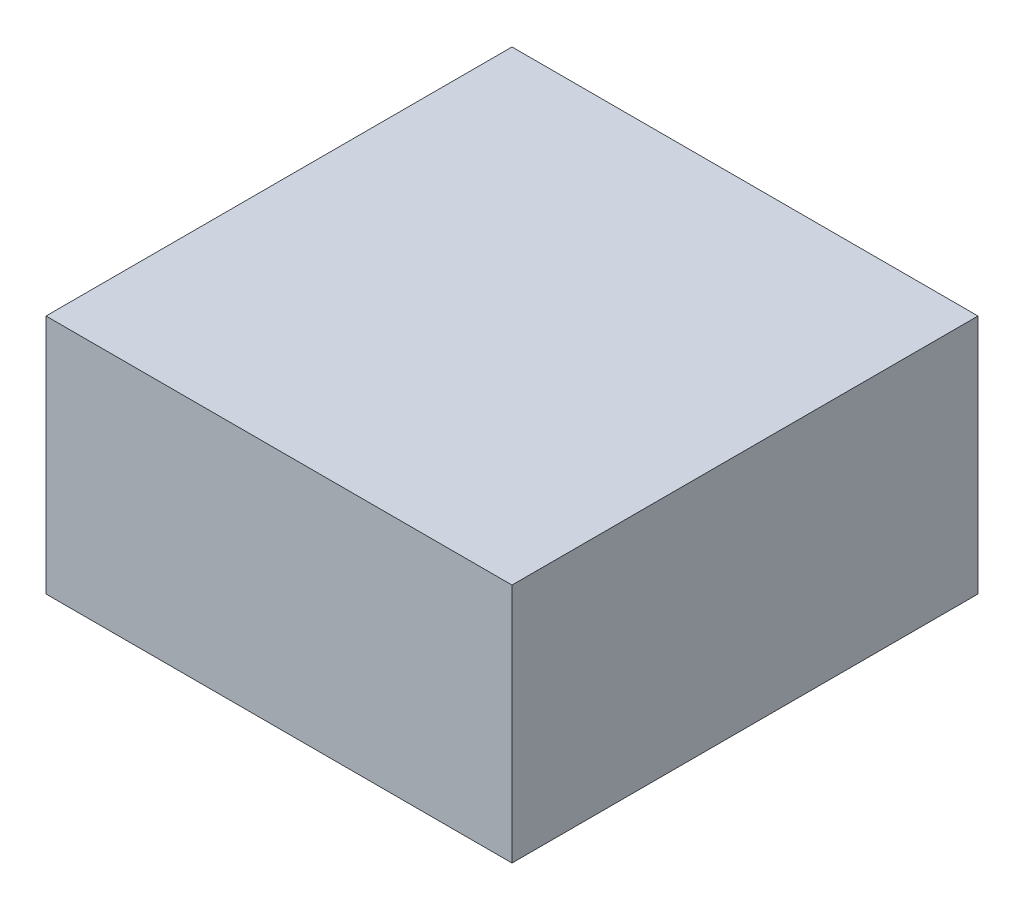
ISO-10303-21;
HEADER;
FILE_DESCRIPTION(('STEP AP214'),'2;1');
FILE_NAME('part.step','',(''),(''),'','','');
FILE_SCHEMA(('AUTOMOTIVE_DESIGN { 1 0 10303 214 1 1 1 1 }'));
ENDSEC;
DATA;
#1=APPLICATION_CONTEXT('core data for automotive mechanical design processes');
#2=APPLICATION_PROTOCOL_DEFINITION('international standard','automotive_design',2000,#1);
#3=PRODUCT_CONTEXT('',#1,'mechanical');
#4=PRODUCT('Part','Part','',(#3));
#5=PRODUCT_RELATED_PRODUCT_CATEGORY('part','',(#4));
#6=PRODUCT_DEFINITION_FORMATION('','',#4);
#7=PRODUCT_DEFINITION_CONTEXT('part definition',#1,'design');
#8=PRODUCT_DEFINITION('design','',#6,#7);
#9=PRODUCT_DEFINITION_SHAPE('','',#8);
#10=(LENGTH_UNIT() NAMED_UNIT(*) SI_UNIT(.MILLI.,.METRE.));
#11=(NAMED_UNIT(*) PLANE_ANGLE_UNIT() SI_UNIT($,.RADIAN.));
#12=(NAMED_UNIT(*) SI_UNIT($,.STERADIAN.) SOLID_ANGLE_UNIT());
#13=UNCERTAINTY_MEASURE_WITH_UNIT(LENGTH_MEASURE(1.E-05),#10,'distance_accuracy_value','');
#14=(GEOMETRIC_REPRESENTATION_CONTEXT(3) GLOBAL_UNCERTAINTY_ASSIGNED_CONTEXT((#13)) GLOBAL_UNIT_ASSIGNED_CONTEXT((#10,
#11,#12)) REPRESENTATION_CONTEXT('',''));
#15=CARTESIAN_POINT('',(0.,0.,0.));
#16=DIRECTION('',(0.,0.,1.));
#17=DIRECTION('',(1.,0.,0.));
#18=AXIS2_PLACEMENT_3D('',#15,#16,#17);
#19=CARTESIAN_POINT('',(-72.08658338126,-2.126384400525,-44.48106509227));
#20=DIRECTION('',(0.,1.,0.));
#21=DIRECTION('',(0.,0.,1.));
#22=AXIS2_PLACEMENT_3D('',#19,#20,#21);
#23=PLANE('',#22);
#24=DIRECTION('',(0.,0.,1.));
#25=VECTOR('',#24,1.);
#26=CARTESIAN_POINT('',(-74.9949936611,-2.126384400522,-46.32331973764));
#27=LINE('',#26,#25);
#28=CARTESIAN_POINT('',(-74.9949936611,-2.12638440052275,-46.32331973764));
#29=VERTEX_POINT('',#28);
#30=CARTESIAN_POINT('',(-74.9949936611,-2.12638440052225,-46.62331973764));
#31=VERTEX_POINT('',#30);
#32=EDGE_CURVE('E67',#29,#31,#27,.F.);
#33=ORIENTED_EDGE('',*,*,#32,.T.);
#34=DIRECTION('',(1.,0.,0.));
#35=VECTOR('',#34,1.);
#36=CARTESIAN_POINT('',(-69.6449936611,-2.126384400521,-46.62331973764));
#37=LINE('',#36,#35);
#38=CARTESIAN_POINT('',(-75.2949936611,-2.126384400517,-46.62331973764));
#39=VERTEX_POINT('',#38);
#40=EDGE_CURVE('E54',#31,#39,#37,.F.);
#41=ORIENTED_EDGE('',*,*,#40,.T.);
#42=DIRECTION('',(0.,0.,1.));
#43=VECTOR('',#42,1.);
#44=CARTESIAN_POINT('',(-75.2949936611,-2.126384400511,-46.32331973764));
#45=LINE('',#44,#43);
#46=CARTESIAN_POINT('',(-75.2949936611,-2.12638440052075,-46.32331973764));
#47=VERTEX_POINT('',#46);
#48=EDGE_CURVE('E19',#47,#39,#45,.F.);
#49=ORIENTED_EDGE('',*,*,#48,.F.);
#50=DIRECTION('',(1.,0.,0.));
#51=VECTOR('',#50,1.);
#52=CARTESIAN_POINT('',(-69.6449936611,-2.126384400522,-46.32331973764));
#53=LINE('',#52,#51);
#54=EDGE_CURVE('E79',#29,#47,#53,.F.);
#55=ORIENTED_EDGE('',*,*,#54,.F.);
#56=EDGE_LOOP('',(#33,#41,#49,#55));
#57=FACE_BOUND('',#56,.T.);
#58=ADVANCED_FACE('F16',(#57),#23,.T.);
#59=CARTESIAN_POINT('',(-75.2949936611,-2.216384400507,-46.32331973764));
#60=DIRECTION('',(-1.,0.,0.));
#61=DIRECTION('',(0.,0.,1.));
#62=AXIS2_PLACEMENT_3D('',#59,#60,#61);
#63=PLANE('',#62);
#64=ORIENTED_EDGE('',*,*,#48,.T.);
#65=DIRECTION('',(0.,1.,0.));
#66=VECTOR('',#65,1.);
#67=CARTESIAN_POINT('',(-75.2949936611,-2.216384400507,-46.62331973764));
#68=LINE('',#67,#66);
#69=CARTESIAN_POINT('',(-75.2949936611,-2.281384400507,-46.62331973764));
#70=VERTEX_POINT('',#69);
#71=EDGE_CURVE('E60',#39,#70,#68,.F.);
#72=ORIENTED_EDGE('',*,*,#71,.T.);
#73=DIRECTION('',(0.,0.,-1.));
#74=VECTOR('',#73,1.);
#75=CARTESIAN_POINT('',(-75.2949936611,-2.281384400507,-46.32331973764));
#76=LINE('',#75,#74);
#77=CARTESIAN_POINT('',(-75.2949936611,-2.281384400507,-46.32331973764));
#78=VERTEX_POINT('',#77);
#79=EDGE_CURVE('E82',#78,#70,#76,.T.);
#80=ORIENTED_EDGE('',*,*,#79,.F.);
#81=DIRECTION('',(0.,1.,0.));
#82=VECTOR('',#81,1.);
#83=CARTESIAN_POINT('',(-75.2949936611,-2.216384400507,-46.32331973764));
#84=LINE('',#83,#82);
#85=EDGE_CURVE('E63',#47,#78,#84,.F.);
#86=ORIENTED_EDGE('',*,*,#85,.F.);
#87=EDGE_LOOP('',(#64,#72,#80,#86));
#88=FACE_BOUND('',#87,.T.);
#89=ADVANCED_FACE('F59',(#88),#63,.T.);
#90=CARTESIAN_POINT('',(-69.6449936611,-2.216384400507,-46.62331973764));
#91=DIRECTION('',(0.,0.,1.));
#92=DIRECTION('',(1.,0.,0.));
#93=AXIS2_PLACEMENT_3D('',#90,#91,#92);
#94=PLANE('',#93);
#95=DIRECTION('',(0.,1.,0.));
#96=VECTOR('',#95,1.);
#97=CARTESIAN_POINT('',(-74.9949936611,-2.216384400507,-46.62331973764));
#98=LINE('',#97,#96);
#99=CARTESIAN_POINT('',(-74.9949936611,-2.281384400507,-46.62331973764));
#100=VERTEX_POINT('',#99);
#101=EDGE_CURVE('E69',#31,#100,#98,.F.);
#102=ORIENTED_EDGE('',*,*,#101,.T.);
#103=DIRECTION('',(1.,0.,0.));
#104=VECTOR('',#103,1.);
#105=CARTESIAN_POINT('',(-69.6449936611,-2.281384400507,-46.62331973764));
#106=LINE('',#105,#104);
#107=EDGE_CURVE('E73',#70,#100,#106,.T.);
#108=ORIENTED_EDGE('',*,*,#107,.F.);
#109=ORIENTED_EDGE('',*,*,#71,.F.);
#110=ORIENTED_EDGE('',*,*,#40,.F.);
#111=EDGE_LOOP('',(#102,#108,#109,#110));
#112=FACE_BOUND('',#111,.T.);
#113=ADVANCED_FACE('F71',(#112),#94,.F.);
#114=CARTESIAN_POINT('',(-74.9949936611,-2.216384400507,-46.32331973764));
#115=DIRECTION('',(-1.,0.,0.));
#116=DIRECTION('',(0.,0.,1.));
#117=AXIS2_PLACEMENT_3D('',#114,#115,#116);
#118=PLANE('',#117);
#119=DIRECTION('',(0.,1.,0.));
#120=VECTOR('',#119,1.);
#121=CARTESIAN_POINT('',(-74.9949936611,-2.216384400507,-46.32331973764));
#122=LINE('',#121,#120);
#123=CARTESIAN_POINT('',(-74.9949936611,-2.281384400507,-46.32331973764));
#124=VERTEX_POINT('',#123);
#125=EDGE_CURVE('E34',#124,#29,#122,.T.);
#126=ORIENTED_EDGE('',*,*,#125,.F.);
#127=DIRECTION('',(0.,0.,-1.));
#128=VECTOR('',#127,1.);
#129=CARTESIAN_POINT('',(-74.9949936611,-2.281384400507,-46.32331973764));
#130=LINE('',#129,#128);
#131=EDGE_CURVE('E25',#100,#124,#130,.F.);
#132=ORIENTED_EDGE('',*,*,#131,.F.);
#133=ORIENTED_EDGE('',*,*,#101,.F.);
#134=ORIENTED_EDGE('',*,*,#32,.F.);
#135=EDGE_LOOP('',(#126,#132,#133,#134));
#136=FACE_BOUND('',#135,.T.);
#137=ADVANCED_FACE('F88',(#136),#118,.F.);
#138=CARTESIAN_POINT('',(-69.6449936611,-2.216384400507,-46.32331973764));
#139=DIRECTION('',(0.,0.,1.));
#140=DIRECTION('',(1.,0.,0.));
#141=AXIS2_PLACEMENT_3D('',#138,#139,#140);
#142=PLANE('',#141);
#143=ORIENTED_EDGE('',*,*,#54,.T.);
#144=ORIENTED_EDGE('',*,*,#85,.T.);
#145=DIRECTION('',(1.,0.,0.));
#146=VECTOR('',#145,1.);
#147=CARTESIAN_POINT('',(-69.6449936611,-2.281384400507,-46.32331973764));
#148=LINE('',#147,#146);
#149=EDGE_CURVE('E11',#124,#78,#148,.F.);
#150=ORIENTED_EDGE('',*,*,#149,.F.);
#151=ORIENTED_EDGE('',*,*,#125,.T.);
#152=EDGE_LOOP('',(#143,#144,#150,#151));
#153=FACE_BOUND('',#152,.T.);
#154=ADVANCED_FACE('F90',(#153),#142,.T.);
#155=CARTESIAN_POINT('',(-69.6449936611,-2.281384400507,-46.32331973764));
#156=DIRECTION('',(0.,-1.,0.));
#157=DIRECTION('',(0.,0.,-1.));
#158=AXIS2_PLACEMENT_3D('',#155,#156,#157);
#159=PLANE('',#158);
#160=ORIENTED_EDGE('',*,*,#131,.T.);
#161=ORIENTED_EDGE('',*,*,#149,.T.);
#162=ORIENTED_EDGE('',*,*,#79,.T.);
#163=ORIENTED_EDGE('',*,*,#107,.T.);
#164=EDGE_LOOP('',(#160,#161,#162,#163));
#165=FACE_BOUND('',#164,.T.);
#166=ADVANCED_FACE('F87',(#165),#159,.T.);
#167=CLOSED_SHELL('',(#58,#89,#113,#137,#154,#166));
#168=MANIFOLD_SOLID_BREP('B1',#167);
#169=ADVANCED_BREP_SHAPE_REPRESENTATION('',(#18,#168),#14);
#170=SHAPE_DEFINITION_REPRESENTATION(#9,#169);
ENDSEC;
END-ISO-10303-21;
